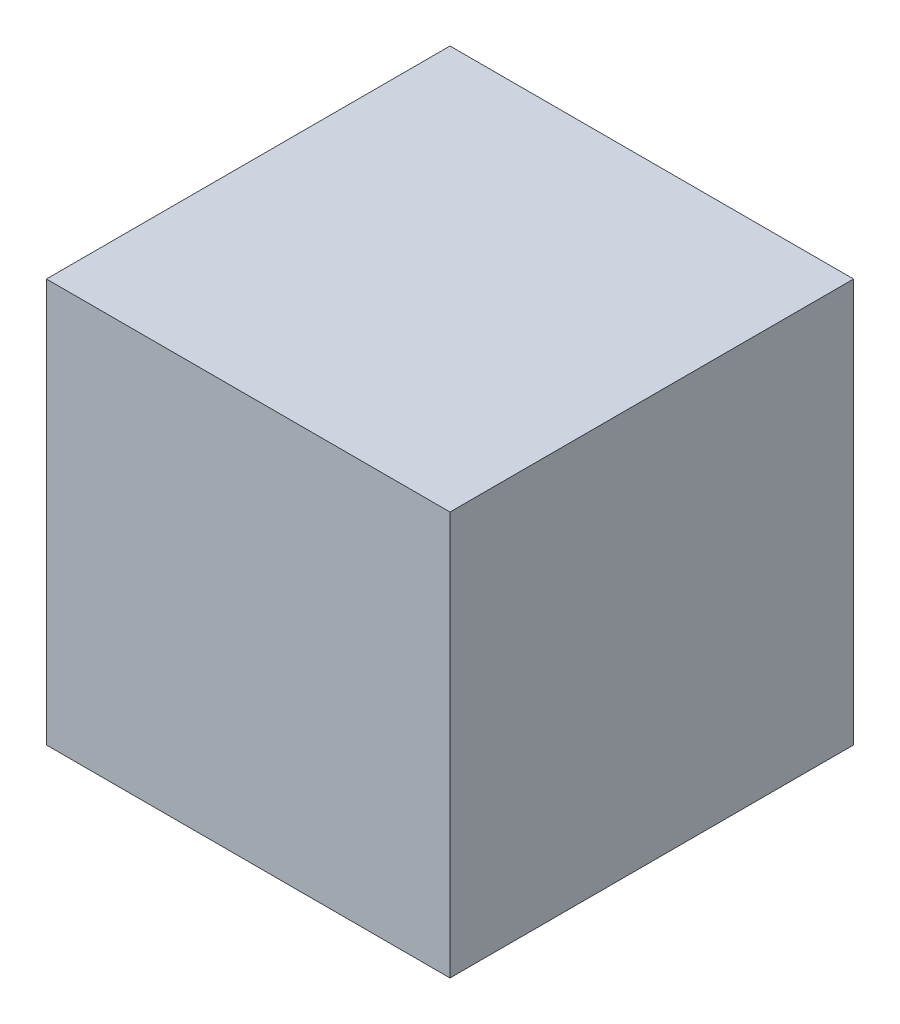
ISO-10303-21;
HEADER;
FILE_DESCRIPTION(('STEP AP214'),'2;1');
FILE_NAME('part.step','',(''),(''),'','','');
FILE_SCHEMA(('AUTOMOTIVE_DESIGN { 1 0 10303 214 1 1 1 1 }'));
ENDSEC;
DATA;
#1=APPLICATION_CONTEXT('core data for automotive mechanical design processes');
#2=APPLICATION_PROTOCOL_DEFINITION('international standard','automotive_design',2000,#1);
#3=PRODUCT_CONTEXT('',#1,'mechanical');
#4=PRODUCT('Part','Part','',(#3));
#5=PRODUCT_RELATED_PRODUCT_CATEGORY('part','',(#4));
#6=PRODUCT_DEFINITION_FORMATION('','',#4);
#7=PRODUCT_DEFINITION_CONTEXT('part definition',#1,'design');
#8=PRODUCT_DEFINITION('design','',#6,#7);
#9=PRODUCT_DEFINITION_SHAPE('','',#8);
#10=(LENGTH_UNIT() NAMED_UNIT(*) SI_UNIT(.MILLI.,.METRE.));
#11=(NAMED_UNIT(*) PLANE_ANGLE_UNIT() SI_UNIT($,.RADIAN.));
#12=(NAMED_UNIT(*) SI_UNIT($,.STERADIAN.) SOLID_ANGLE_UNIT());
#13=UNCERTAINTY_MEASURE_WITH_UNIT(LENGTH_MEASURE(1.E-05),#10,'distance_accuracy_value','');
#14=(GEOMETRIC_REPRESENTATION_CONTEXT(3) GLOBAL_UNCERTAINTY_ASSIGNED_CONTEXT((#13)) GLOBAL_UNIT_ASSIGNED_CONTEXT((#10,
#11,#12)) REPRESENTATION_CONTEXT('',''));
#15=CARTESIAN_POINT('',(0.,0.,0.));
#16=DIRECTION('',(0.,0.,1.));
#17=DIRECTION('',(1.,0.,0.));
#18=AXIS2_PLACEMENT_3D('',#15,#16,#17);
#19=CARTESIAN_POINT('',(0.,152.4,0.));
#20=DIRECTION('',(0.,1.,0.));
#21=DIRECTION('',(0.,0.,1.));
#22=AXIS2_PLACEMENT_3D('',#19,#20,#21);
#23=PLANE('',#22);
#24=DIRECTION('',(1.,0.,0.));
#25=VECTOR('',#24,1.);
#26=CARTESIAN_POINT('',(-76.2,152.4,76.2));
#27=LINE('',#26,#25);
#28=CARTESIAN_POINT('',(76.2,152.4,76.2));
#29=VERTEX_POINT('',#28);
#30=CARTESIAN_POINT('',(-76.2,152.4,76.2));
#31=VERTEX_POINT('',#30);
#32=EDGE_CURVE('E75',#29,#31,#27,.F.);
#33=ORIENTED_EDGE('',*,*,#32,.F.);
#34=DIRECTION('',(0.,0.,-1.));
#35=VECTOR('',#34,1.);
#36=CARTESIAN_POINT('',(76.2,152.4,76.2));
#37=LINE('',#36,#35);
#38=CARTESIAN_POINT('',(76.2,152.4,-76.2));
#39=VERTEX_POINT('',#38);
#40=EDGE_CURVE('E57',#39,#29,#37,.F.);
#41=ORIENTED_EDGE('',*,*,#40,.F.);
#42=DIRECTION('',(-1.,0.,0.));
#43=VECTOR('',#42,1.);
#44=CARTESIAN_POINT('',(76.2,152.4,-76.2));
#45=LINE('',#44,#43);
#46=CARTESIAN_POINT('',(-76.2,152.4,-76.2));
#47=VERTEX_POINT('',#46);
#48=EDGE_CURVE('E19',#47,#39,#45,.F.);
#49=ORIENTED_EDGE('',*,*,#48,.F.);
#50=DIRECTION('',(0.,0.,1.));
#51=VECTOR('',#50,1.);
#52=CARTESIAN_POINT('',(-76.2,152.4,-76.2));
#53=LINE('',#52,#51);
#54=EDGE_CURVE('E54',#31,#47,#53,.F.);
#55=ORIENTED_EDGE('',*,*,#54,.F.);
#56=EDGE_LOOP('',(#33,#41,#49,#55));
#57=FACE_BOUND('',#56,.T.);
#58=ADVANCED_FACE('F16',(#57),#23,.T.);
#59=CARTESIAN_POINT('',(76.2,0.,-76.2));
#60=DIRECTION('',(0.,0.,-1.));
#61=DIRECTION('',(-1.,0.,0.));
#62=AXIS2_PLACEMENT_3D('',#59,#60,#61);
#63=PLANE('',#62);
#64=DIRECTION('',(0.,1.,0.));
#65=VECTOR('',#64,1.);
#66=CARTESIAN_POINT('',(-76.2,0.,-76.2));
#67=LINE('',#66,#65);
#68=CARTESIAN_POINT('',(-76.2,0.,-76.2));
#69=VERTEX_POINT('',#68);
#70=EDGE_CURVE('E62',#47,#69,#67,.F.);
#71=ORIENTED_EDGE('',*,*,#70,.F.);
#72=ORIENTED_EDGE('',*,*,#48,.T.);
#73=DIRECTION('',(0.,1.,0.));
#74=VECTOR('',#73,1.);
#75=CARTESIAN_POINT('',(76.2,0.,-76.2));
#76=LINE('',#75,#74);
#77=CARTESIAN_POINT('',(76.2,0.,-76.2));
#78=VERTEX_POINT('',#77);
#79=EDGE_CURVE('E78',#78,#39,#76,.T.);
#80=ORIENTED_EDGE('',*,*,#79,.F.);
#81=DIRECTION('',(1.,0.,0.));
#82=VECTOR('',#81,1.);
#83=CARTESIAN_POINT('',(0.,0.,-76.2));
#84=LINE('',#83,#82);
#85=EDGE_CURVE('E72',#78,#69,#84,.F.);
#86=ORIENTED_EDGE('',*,*,#85,.T.);
#87=EDGE_LOOP('',(#71,#72,#80,#86));
#88=FACE_BOUND('',#87,.T.);
#89=ADVANCED_FACE('F71',(#88),#63,.T.);
#90=CARTESIAN_POINT('',(-76.2,0.,-76.2));
#91=DIRECTION('',(-1.,0.,0.));
#92=DIRECTION('',(0.,0.,1.));
#93=AXIS2_PLACEMENT_3D('',#90,#91,#92);
#94=PLANE('',#93);
#95=DIRECTION('',(0.,1.,0.));
#96=VECTOR('',#95,1.);
#97=CARTESIAN_POINT('',(-76.2,0.,76.2));
#98=LINE('',#97,#96);
#99=CARTESIAN_POINT('',(-76.2,0.,76.2));
#100=VERTEX_POINT('',#99);
#101=EDGE_CURVE('E68',#31,#100,#98,.F.);
#102=ORIENTED_EDGE('',*,*,#101,.F.);
#103=ORIENTED_EDGE('',*,*,#54,.T.);
#104=ORIENTED_EDGE('',*,*,#70,.T.);
#105=DIRECTION('',(0.,0.,1.));
#106=VECTOR('',#105,1.);
#107=CARTESIAN_POINT('',(-76.2,0.,0.));
#108=LINE('',#107,#106);
#109=EDGE_CURVE('E82',#69,#100,#108,.T.);
#110=ORIENTED_EDGE('',*,*,#109,.T.);
#111=EDGE_LOOP('',(#102,#103,#104,#110));
#112=FACE_BOUND('',#111,.T.);
#113=ADVANCED_FACE('F65',(#112),#94,.T.);
#114=CARTESIAN_POINT('',(-76.2,0.,76.2));
#115=DIRECTION('',(0.,0.,1.));
#116=DIRECTION('',(1.,0.,0.));
#117=AXIS2_PLACEMENT_3D('',#114,#115,#116);
#118=PLANE('',#117);
#119=DIRECTION('',(0.,1.,0.));
#120=VECTOR('',#119,1.);
#121=CARTESIAN_POINT('',(76.2,0.,76.2));
#122=LINE('',#121,#120);
#123=CARTESIAN_POINT('',(76.2,0.,76.2));
#124=VERTEX_POINT('',#123);
#125=EDGE_CURVE('E33',#29,#124,#122,.F.);
#126=ORIENTED_EDGE('',*,*,#125,.F.);
#127=ORIENTED_EDGE('',*,*,#32,.T.);
#128=ORIENTED_EDGE('',*,*,#101,.T.);
#129=DIRECTION('',(1.,0.,0.));
#130=VECTOR('',#129,1.);
#131=CARTESIAN_POINT('',(0.,0.,76.2));
#132=LINE('',#131,#130);
#133=EDGE_CURVE('E25',#100,#124,#132,.T.);
#134=ORIENTED_EDGE('',*,*,#133,.T.);
#135=EDGE_LOOP('',(#126,#127,#128,#134));
#136=FACE_BOUND('',#135,.T.);
#137=ADVANCED_FACE('F87',(#136),#118,.T.);
#138=CARTESIAN_POINT('',(76.2,0.,76.2));
#139=DIRECTION('',(1.,0.,0.));
#140=DIRECTION('',(0.,0.,-1.));
#141=AXIS2_PLACEMENT_3D('',#138,#139,#140);
#142=PLANE('',#141);
#143=ORIENTED_EDGE('',*,*,#79,.T.);
#144=ORIENTED_EDGE('',*,*,#40,.T.);
#145=ORIENTED_EDGE('',*,*,#125,.T.);
#146=DIRECTION('',(0.,0.,1.));
#147=VECTOR('',#146,1.);
#148=CARTESIAN_POINT('',(76.2,0.,0.));
#149=LINE('',#148,#147);
#150=EDGE_CURVE('E11',#124,#78,#149,.F.);
#151=ORIENTED_EDGE('',*,*,#150,.T.);
#152=EDGE_LOOP('',(#143,#144,#145,#151));
#153=FACE_BOUND('',#152,.T.);
#154=ADVANCED_FACE('F90',(#153),#142,.T.);
#155=CARTESIAN_POINT('',(0.,0.,0.));
#156=DIRECTION('',(0.,1.,0.));
#157=DIRECTION('',(0.,0.,1.));
#158=AXIS2_PLACEMENT_3D('',#155,#156,#157);
#159=PLANE('',#158);
#160=ORIENTED_EDGE('',*,*,#133,.F.);
#161=ORIENTED_EDGE('',*,*,#109,.F.);
#162=ORIENTED_EDGE('',*,*,#85,.F.);
#163=ORIENTED_EDGE('',*,*,#150,.F.);
#164=EDGE_LOOP('',(#160,#161,#162,#163));
#165=FACE_BOUND('',#164,.T.);
#166=ADVANCED_FACE('F89',(#165),#159,.F.);
#167=CLOSED_SHELL('',(#58,#89,#113,#137,#154,#166));
#168=MANIFOLD_SOLID_BREP('B1',#167);
#169=ADVANCED_BREP_SHAPE_REPRESENTATION('',(#18,#168),#14);
#170=SHAPE_DEFINITION_REPRESENTATION(#9,#169);
ENDSEC;
END-ISO-10303-21;
